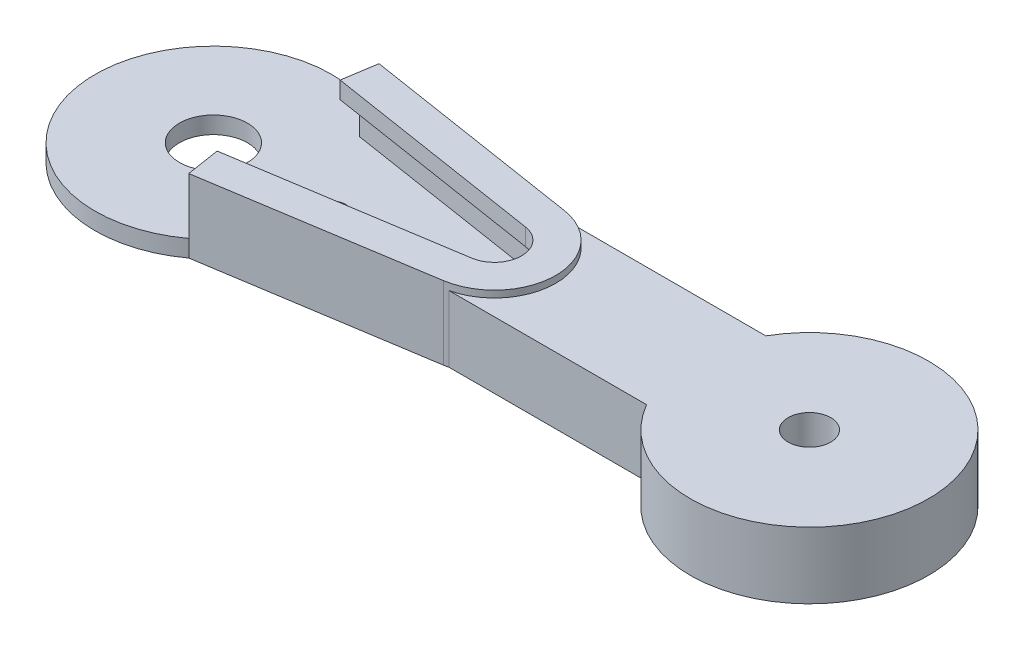
ISO-10303-21;
HEADER;
FILE_DESCRIPTION(('STEP AP214'),'2;1');
FILE_NAME('part.step','',(''),(''),'','','');
FILE_SCHEMA(('AUTOMOTIVE_DESIGN { 1 0 10303 214 1 1 1 1 }'));
ENDSEC;
DATA;
#1=APPLICATION_CONTEXT('core data for automotive mechanical design processes');
#2=APPLICATION_PROTOCOL_DEFINITION('international standard','automotive_design',2000,#1);
#3=PRODUCT_CONTEXT('',#1,'mechanical');
#4=PRODUCT('Part','Part','',(#3));
#5=PRODUCT_RELATED_PRODUCT_CATEGORY('part','',(#4));
#6=PRODUCT_DEFINITION_FORMATION('','',#4);
#7=PRODUCT_DEFINITION_CONTEXT('part definition',#1,'design');
#8=PRODUCT_DEFINITION('design','',#6,#7);
#9=PRODUCT_DEFINITION_SHAPE('','',#8);
#10=(LENGTH_UNIT() NAMED_UNIT(*) SI_UNIT(.MILLI.,.METRE.));
#11=(NAMED_UNIT(*) PLANE_ANGLE_UNIT() SI_UNIT($,.RADIAN.));
#12=(NAMED_UNIT(*) SI_UNIT($,.STERADIAN.) SOLID_ANGLE_UNIT());
#13=UNCERTAINTY_MEASURE_WITH_UNIT(LENGTH_MEASURE(1.E-05),#10,'distance_accuracy_value','');
#14=(GEOMETRIC_REPRESENTATION_CONTEXT(3) GLOBAL_UNCERTAINTY_ASSIGNED_CONTEXT((#13)) GLOBAL_UNIT_ASSIGNED_CONTEXT((#10,
#11,#12)) REPRESENTATION_CONTEXT('',''));
#15=CARTESIAN_POINT('',(0.,0.,0.));
#16=DIRECTION('',(0.,0.,1.));
#17=DIRECTION('',(1.,0.,0.));
#18=AXIS2_PLACEMENT_3D('',#15,#16,#17);
#19=CARTESIAN_POINT('',(7.,1.15,0.));
#20=DIRECTION('',(0.,-1.,0.));
#21=DIRECTION('',(0.,0.,-1.));
#22=AXIS2_PLACEMENT_3D('',#19,#20,#21);
#23=CYLINDRICAL_SURFACE('',#22,0.750000000000002);
#24=CARTESIAN_POINT('',(7.,-2.15,0.));
#25=DIRECTION('',(0.,-1.,0.));
#26=DIRECTION('',(0.,0.,-1.));
#27=AXIS2_PLACEMENT_3D('',#24,#25,#26);
#28=CIRCLE('',#27,0.749999999999999);
#29=CARTESIAN_POINT('',(7.,-2.15,-0.749999999999999));
#30=VERTEX_POINT('',#29);
#31=EDGE_CURVE('E290',#30,#30,#28,.T.);
#32=ORIENTED_EDGE('',*,*,#31,.T.);
#33=EDGE_LOOP('',(#32));
#34=FACE_BOUND('',#33,.T.);
#35=CARTESIAN_POINT('',(7.,-1.15,0.));
#36=DIRECTION('',(0.,1.,0.));
#37=DIRECTION('',(0.,0.,1.));
#38=AXIS2_PLACEMENT_3D('',#35,#36,#37);
#39=CIRCLE('',#38,0.750000000000002);
#40=CARTESIAN_POINT('',(7.,-1.15,0.750000000000065));
#41=VERTEX_POINT('',#40);
#42=EDGE_CURVE('E375',#41,#41,#39,.T.);
#43=ORIENTED_EDGE('',*,*,#42,.T.);
#44=EDGE_LOOP('',(#43));
#45=FACE_BOUND('',#44,.T.);
#46=ADVANCED_FACE('F47',(#34,#45),#23,.F.);
#47=CARTESIAN_POINT('',(16.,1.15,0.));
#48=DIRECTION('',(0.,-1.,0.));
#49=DIRECTION('',(0.,0.,-1.));
#50=AXIS2_PLACEMENT_3D('',#47,#48,#49);
#51=CYLINDRICAL_SURFACE('',#50,0.750000000000002);
#52=CARTESIAN_POINT('',(16.,-2.15,0.));
#53=DIRECTION('',(0.,-1.,0.));
#54=DIRECTION('',(0.,0.,-1.));
#55=AXIS2_PLACEMENT_3D('',#52,#53,#54);
#56=CIRCLE('',#55,0.749999999999998);
#57=CARTESIAN_POINT('',(16.,-2.15,-0.749999999999998));
#58=VERTEX_POINT('',#57);
#59=EDGE_CURVE('E386',#58,#58,#56,.T.);
#60=ORIENTED_EDGE('',*,*,#59,.T.);
#61=EDGE_LOOP('',(#60));
#62=FACE_BOUND('',#61,.T.);
#63=CARTESIAN_POINT('',(16.,-1.15,0.));
#64=DIRECTION('',(0.,1.,0.));
#65=DIRECTION('',(0.,0.,1.));
#66=AXIS2_PLACEMENT_3D('',#63,#64,#65);
#67=CIRCLE('',#66,0.750000000000002);
#68=CARTESIAN_POINT('',(16.,-1.15,0.750000000000002));
#69=VERTEX_POINT('',#68);
#70=EDGE_CURVE('E385',#69,#69,#67,.T.);
#71=ORIENTED_EDGE('',*,*,#70,.T.);
#72=EDGE_LOOP('',(#71));
#73=FACE_BOUND('',#72,.T.);
#74=ADVANCED_FACE('F451',(#62,#73),#51,.F.);
#75=CARTESIAN_POINT('',(13.,1.15,0.));
#76=DIRECTION('',(0.,-1.,0.));
#77=DIRECTION('',(0.,0.,-1.));
#78=AXIS2_PLACEMENT_3D('',#75,#76,#77);
#79=CYLINDRICAL_SURFACE('',#78,0.750000000000002);
#80=CARTESIAN_POINT('',(13.,-2.15,0.));
#81=DIRECTION('',(0.,-1.,0.));
#82=DIRECTION('',(0.,0.,-1.));
#83=AXIS2_PLACEMENT_3D('',#80,#81,#82);
#84=CIRCLE('',#83,0.749999999999998);
#85=CARTESIAN_POINT('',(13.,-2.15,-0.749999999999998));
#86=VERTEX_POINT('',#85);
#87=EDGE_CURVE('E381',#86,#86,#84,.T.);
#88=ORIENTED_EDGE('',*,*,#87,.T.);
#89=EDGE_LOOP('',(#88));
#90=FACE_BOUND('',#89,.T.);
#91=CARTESIAN_POINT('',(13.,-1.15,0.));
#92=DIRECTION('',(0.,1.,0.));
#93=DIRECTION('',(0.,0.,1.));
#94=AXIS2_PLACEMENT_3D('',#91,#92,#93);
#95=CIRCLE('',#94,0.750000000000002);
#96=CARTESIAN_POINT('',(13.,-1.15,0.750000000000023));
#97=VERTEX_POINT('',#96);
#98=EDGE_CURVE('E380',#97,#97,#95,.T.);
#99=ORIENTED_EDGE('',*,*,#98,.T.);
#100=EDGE_LOOP('',(#99));
#101=FACE_BOUND('',#100,.T.);
#102=ADVANCED_FACE('F457',(#90,#101),#79,.F.);
#103=CARTESIAN_POINT('',(10.,1.15,0.));
#104=DIRECTION('',(0.,-1.,0.));
#105=DIRECTION('',(0.,0.,-1.));
#106=AXIS2_PLACEMENT_3D('',#103,#104,#105);
#107=CYLINDRICAL_SURFACE('',#106,0.750000000000002);
#108=CARTESIAN_POINT('',(10.,-2.15,0.));
#109=DIRECTION('',(0.,-1.,0.));
#110=DIRECTION('',(0.,0.,-1.));
#111=AXIS2_PLACEMENT_3D('',#108,#109,#110);
#112=CIRCLE('',#111,0.75);
#113=CARTESIAN_POINT('',(10.,-2.15,-0.75));
#114=VERTEX_POINT('',#113);
#115=EDGE_CURVE('E376',#114,#114,#112,.T.);
#116=ORIENTED_EDGE('',*,*,#115,.T.);
#117=EDGE_LOOP('',(#116));
#118=FACE_BOUND('',#117,.T.);
#119=CARTESIAN_POINT('',(10.,-1.15,0.));
#120=DIRECTION('',(0.,1.,0.));
#121=DIRECTION('',(0.,0.,1.));
#122=AXIS2_PLACEMENT_3D('',#119,#120,#121);
#123=CIRCLE('',#122,0.750000000000002);
#124=CARTESIAN_POINT('',(10.,-1.15,0.750000000000044));
#125=VERTEX_POINT('',#124);
#126=EDGE_CURVE('E331',#125,#125,#123,.T.);
#127=ORIENTED_EDGE('',*,*,#126,.T.);
#128=EDGE_LOOP('',(#127));
#129=FACE_BOUND('',#128,.T.);
#130=ADVANCED_FACE('F402',(#118,#129),#107,.F.);
#131=CARTESIAN_POINT('',(0.,-2.15,0.));
#132=DIRECTION('',(0.,1.,0.));
#133=DIRECTION('',(0.,0.,1.));
#134=AXIS2_PLACEMENT_3D('',#131,#132,#133);
#135=CYLINDRICAL_SURFACE('',#134,2.);
#136=CARTESIAN_POINT('',(0.,-2.15,0.));
#137=DIRECTION('',(0.,-1.,0.));
#138=DIRECTION('',(0.,0.,-1.));
#139=AXIS2_PLACEMENT_3D('',#136,#137,#138);
#140=CIRCLE('',#139,2.);
#141=CARTESIAN_POINT('',(0.,-2.15,-2.));
#142=VERTEX_POINT('',#141);
#143=EDGE_CURVE('E327',#142,#142,#140,.T.);
#144=ORIENTED_EDGE('',*,*,#143,.T.);
#145=EDGE_LOOP('',(#144));
#146=FACE_BOUND('',#145,.T.);
#147=CARTESIAN_POINT('',(0.,-1.15,0.));
#148=DIRECTION('',(0.,1.,0.));
#149=DIRECTION('',(0.,0.,1.));
#150=AXIS2_PLACEMENT_3D('',#147,#148,#149);
#151=CIRCLE('',#150,2.);
#152=CARTESIAN_POINT('',(0.,-1.15,2.));
#153=VERTEX_POINT('',#152);
#154=EDGE_CURVE('E51',#153,#153,#151,.T.);
#155=ORIENTED_EDGE('',*,*,#154,.T.);
#156=EDGE_LOOP('',(#155));
#157=FACE_BOUND('',#156,.T.);
#158=ADVANCED_FACE('F470',(#146,#157),#135,.F.);
#159=CARTESIAN_POINT('',(17.0588844447433,-2.15,3.55635321325428));
#160=DIRECTION('',(-0.155245679095352,0.,-0.987875892570632));
#161=DIRECTION('',(-0.987875892570632,0.,0.155245679095352));
#162=AXIS2_PLACEMENT_3D('',#159,#160,#161);
#163=PLANE('',#162);
#164=DIRECTION('',(0.,1.,0.));
#165=VECTOR('',#164,1.);
#166=CARTESIAN_POINT('',(17.0588844447433,-2.15,3.55635321325428));
#167=LINE('',#166,#165);
#168=CARTESIAN_POINT('',(17.0588844447433,-2.15,3.55635321325428));
#169=VERTEX_POINT('',#168);
#170=CARTESIAN_POINT('',(17.0588844447433,2.15,3.55635321325427));
#171=VERTEX_POINT('',#170);
#172=EDGE_CURVE('E300',#169,#171,#167,.T.);
#173=ORIENTED_EDGE('',*,*,#172,.T.);
#174=DIRECTION('',(0.987875892570632,0.,-0.155245679095352));
#175=VECTOR('',#174,1.);
#176=CARTESIAN_POINT('',(0.956554589226585,2.15,6.08685036602117));
#177=LINE('',#176,#175);
#178=CARTESIAN_POINT('',(4.13939721360178,2.15,5.58666348182769));
#179=VERTEX_POINT('',#178);
#180=EDGE_CURVE('E256',#179,#171,#177,.T.);
#181=ORIENTED_EDGE('',*,*,#180,.F.);
#182=DIRECTION('',(0.,-1.,0.));
#183=VECTOR('',#182,1.);
#184=CARTESIAN_POINT('',(4.13939721360178,1.15,5.58666348182769));
#185=LINE('',#184,#183);
#186=CARTESIAN_POINT('',(4.13939721360178,-1.15,5.58666348182769));
#187=VERTEX_POINT('',#186);
#188=EDGE_CURVE('E299',#179,#187,#185,.T.);
#189=ORIENTED_EDGE('',*,*,#188,.T.);
#190=DIRECTION('',(0.,1.,0.));
#191=VECTOR('',#190,1.);
#192=CARTESIAN_POINT('',(4.13939721360177,-2.15,5.5866634818277));
#193=LINE('',#192,#191);
#194=CARTESIAN_POINT('',(4.13939721360177,-2.15,5.5866634818277));
#195=VERTEX_POINT('',#194);
#196=EDGE_CURVE('E303',#195,#187,#193,.T.);
#197=ORIENTED_EDGE('',*,*,#196,.F.);
#198=DIRECTION('',(-0.987875892570632,0.,0.155245679095352));
#199=VECTOR('',#198,1.);
#200=CARTESIAN_POINT('',(17.0588844447433,-2.15,3.55635321325428));
#201=LINE('',#200,#199);
#202=EDGE_CURVE('E310',#169,#195,#201,.T.);
#203=ORIENTED_EDGE('',*,*,#202,.F.);
#204=EDGE_LOOP('',(#173,#181,#189,#197,#203));
#205=FACE_BOUND('',#204,.T.);
#206=ADVANCED_FACE('F426',(#205),#163,.F.);
#207=CARTESIAN_POINT('',(16.5,-2.15,0.));
#208=DIRECTION('',(0.,1.,0.));
#209=DIRECTION('',(0.,0.,1.));
#210=AXIS2_PLACEMENT_3D('',#207,#208,#209);
#211=CYLINDRICAL_SURFACE('',#210,3.6);
#212=CARTESIAN_POINT('',(16.5,1.75,0.));
#213=DIRECTION('',(0.,-1.,0.));
#214=DIRECTION('',(0.,0.,-1.));
#215=AXIS2_PLACEMENT_3D('',#212,#213,#214);
#216=CIRCLE('',#215,3.6);
#217=CARTESIAN_POINT('',(17.3426149773176,1.75,-3.5));
#218=VERTEX_POINT('',#217);
#219=CARTESIAN_POINT('',(17.3426149773176,1.75,3.5));
#220=VERTEX_POINT('',#219);
#221=EDGE_CURVE('E180',#218,#220,#216,.T.);
#222=ORIENTED_EDGE('',*,*,#221,.F.);
#223=DIRECTION('',(0.,-1.,0.));
#224=VECTOR('',#223,1.);
#225=CARTESIAN_POINT('',(17.3426149773176,1.75,-3.5));
#226=LINE('',#225,#224);
#227=CARTESIAN_POINT('',(17.3426149773176,-2.15,-3.5));
#228=VERTEX_POINT('',#227);
#229=EDGE_CURVE('E222',#218,#228,#226,.T.);
#230=ORIENTED_EDGE('',*,*,#229,.T.);
#231=CARTESIAN_POINT('',(16.5,-2.15,0.));
#232=DIRECTION('',(0.,-1.,0.));
#233=DIRECTION('',(0.,0.,-1.));
#234=AXIS2_PLACEMENT_3D('',#231,#232,#233);
#235=CIRCLE('',#234,3.6);
#236=CARTESIAN_POINT('',(17.0588844447433,-2.15,-3.55635321325428));
#237=VERTEX_POINT('',#236);
#238=EDGE_CURVE('E314',#237,#228,#235,.T.);
#239=ORIENTED_EDGE('',*,*,#238,.F.);
#240=DIRECTION('',(0.,1.,0.));
#241=VECTOR('',#240,1.);
#242=CARTESIAN_POINT('',(17.0588844447433,-2.15,-3.55635321325428));
#243=LINE('',#242,#241);
#244=CARTESIAN_POINT('',(17.0588844447433,2.15,-3.55635321325427));
#245=VERTEX_POINT('',#244);
#246=EDGE_CURVE('E296',#237,#245,#243,.T.);
#247=ORIENTED_EDGE('',*,*,#246,.T.);
#248=CARTESIAN_POINT('',(16.5,2.15,0.));
#249=DIRECTION('',(0.,1.,0.));
#250=DIRECTION('',(0.,0.,1.));
#251=AXIS2_PLACEMENT_3D('',#248,#249,#250);
#252=CIRCLE('',#251,3.6);
#253=EDGE_CURVE('E228',#171,#245,#252,.T.);
#254=ORIENTED_EDGE('',*,*,#253,.F.);
#255=ORIENTED_EDGE('',*,*,#172,.F.);
#256=CARTESIAN_POINT('',(17.3426149773176,-2.15,3.5));
#257=VERTEX_POINT('',#256);
#258=EDGE_CURVE('E318',#257,#169,#235,.T.);
#259=ORIENTED_EDGE('',*,*,#258,.F.);
#260=DIRECTION('',(0.,-1.,0.));
#261=VECTOR('',#260,1.);
#262=CARTESIAN_POINT('',(17.3426149773176,1.75,3.5));
#263=LINE('',#262,#261);
#264=EDGE_CURVE('E190',#220,#257,#263,.T.);
#265=ORIENTED_EDGE('',*,*,#264,.F.);
#266=EDGE_LOOP('',(#222,#230,#239,#247,#254,#255,#259,#265));
#267=FACE_BOUND('',#266,.T.);
#268=ADVANCED_FACE('F423',(#267),#211,.T.);
#269=CARTESIAN_POINT('',(4.13939721360177,-2.15,-5.58666348182769));
#270=DIRECTION('',(-0.155245679095352,0.,0.987875892570632));
#271=DIRECTION('',(0.987875892570632,0.,0.155245679095352));
#272=AXIS2_PLACEMENT_3D('',#269,#270,#271);
#273=PLANE('',#272);
#274=DIRECTION('',(0.,1.,0.));
#275=VECTOR('',#274,1.);
#276=CARTESIAN_POINT('',(4.13939721360177,-2.15,-5.58666348182769));
#277=LINE('',#276,#275);
#278=CARTESIAN_POINT('',(4.13939721360177,-2.15,-5.58666348182769));
#279=VERTEX_POINT('',#278);
#280=CARTESIAN_POINT('',(4.13939721360177,-1.15,-5.58666348182769));
#281=VERTEX_POINT('',#280);
#282=EDGE_CURVE('E291',#279,#281,#277,.T.);
#283=ORIENTED_EDGE('',*,*,#282,.T.);
#284=DIRECTION('',(0.,-1.,0.));
#285=VECTOR('',#284,1.);
#286=CARTESIAN_POINT('',(4.13939721360177,1.15,-5.58666348182769));
#287=LINE('',#286,#285);
#288=CARTESIAN_POINT('',(4.13939721360177,2.15,-5.5866634818277));
#289=VERTEX_POINT('',#288);
#290=EDGE_CURVE('E313',#289,#281,#287,.T.);
#291=ORIENTED_EDGE('',*,*,#290,.F.);
#292=DIRECTION('',(-0.987875892570632,0.,-0.155245679095352));
#293=VECTOR('',#292,1.);
#294=CARTESIAN_POINT('',(0.956554589226585,2.15,-6.08685036602117));
#295=LINE('',#294,#293);
#296=EDGE_CURVE('E232',#245,#289,#295,.T.);
#297=ORIENTED_EDGE('',*,*,#296,.F.);
#298=ORIENTED_EDGE('',*,*,#246,.F.);
#299=DIRECTION('',(0.987875892570632,0.,0.155245679095352));
#300=VECTOR('',#299,1.);
#301=CARTESIAN_POINT('',(4.13939721360177,-2.15,-5.58666348182769));
#302=LINE('',#301,#300);
#303=EDGE_CURVE('E319',#279,#237,#302,.T.);
#304=ORIENTED_EDGE('',*,*,#303,.F.);
#305=EDGE_LOOP('',(#283,#291,#297,#298,#304));
#306=FACE_BOUND('',#305,.T.);
#307=ADVANCED_FACE('F436',(#306),#273,.F.);
#308=CARTESIAN_POINT('',(0.,-2.15,0.));
#309=DIRECTION('',(0.,1.,0.));
#310=DIRECTION('',(0.,0.,1.));
#311=AXIS2_PLACEMENT_3D('',#308,#309,#310);
#312=CYLINDRICAL_SURFACE('',#311,6.95308695121536);
#313=CARTESIAN_POINT('',(0.,-1.15,0.));
#314=DIRECTION('',(0.,-1.,0.));
#315=DIRECTION('',(0.,0.,-1.));
#316=AXIS2_PLACEMENT_3D('',#313,#314,#315);
#317=CIRCLE('',#316,6.95308695121536);
#318=EDGE_CURVE('E295',#187,#281,#317,.T.);
#319=ORIENTED_EDGE('',*,*,#318,.T.);
#320=ORIENTED_EDGE('',*,*,#282,.F.);
#321=CARTESIAN_POINT('',(0.,-2.15,0.));
#322=DIRECTION('',(0.,-1.,0.));
#323=DIRECTION('',(0.,0.,-1.));
#324=AXIS2_PLACEMENT_3D('',#321,#322,#323);
#325=CIRCLE('',#324,6.95308695121536);
#326=EDGE_CURVE('E322',#195,#279,#325,.T.);
#327=ORIENTED_EDGE('',*,*,#326,.F.);
#328=ORIENTED_EDGE('',*,*,#196,.T.);
#329=EDGE_LOOP('',(#319,#320,#327,#328));
#330=FACE_BOUND('',#329,.T.);
#331=ADVANCED_FACE('F408',(#330),#312,.T.);
#332=CARTESIAN_POINT('',(0.,-1.15,0.));
#333=DIRECTION('',(0.,-1.,0.));
#334=DIRECTION('',(0.,0.,-1.));
#335=AXIS2_PLACEMENT_3D('',#332,#333,#334);
#336=PLANE('',#335);
#337=DIRECTION('',(-0.987875892570632,0.,-0.155245679095352));
#338=VECTOR('',#337,1.);
#339=CARTESIAN_POINT('',(0.801308910131233,-1.15,-5.09897447345054));
#340=LINE('',#339,#338);
#341=CARTESIAN_POINT('',(16.9036387656479,-1.15,-2.56847732068364));
#342=VERTEX_POINT('',#341);
#343=CARTESIAN_POINT('',(3.98415153450642,-1.15,-4.59878758925706));
#344=VERTEX_POINT('',#343);
#345=EDGE_CURVE('E307',#342,#344,#340,.T.);
#346=ORIENTED_EDGE('',*,*,#345,.T.);
#347=DIRECTION('',(0.15524567909535,0.,-0.987875892570632));
#348=VECTOR('',#347,1.);
#349=CARTESIAN_POINT('',(3.1828426243752,-1.15,0.500186884193477));
#350=LINE('',#349,#348);
#351=EDGE_CURVE('E351',#344,#281,#350,.T.);
#352=ORIENTED_EDGE('',*,*,#351,.T.);
#353=ORIENTED_EDGE('',*,*,#318,.F.);
#354=DIRECTION('',(-0.155245679095351,0.,-0.987875892570632));
#355=VECTOR('',#354,1.);
#356=CARTESIAN_POINT('',(3.18284262437519,-1.15,-0.500186884193479));
#357=LINE('',#356,#355);
#358=CARTESIAN_POINT('',(3.98415153450643,-1.15,4.59878758925706));
#359=VERTEX_POINT('',#358);
#360=EDGE_CURVE('E326',#187,#359,#357,.T.);
#361=ORIENTED_EDGE('',*,*,#360,.T.);
#362=DIRECTION('',(-0.987875892570632,0.,0.155245679095352));
#363=VECTOR('',#362,1.);
#364=CARTESIAN_POINT('',(0.801308910131233,-1.15,5.09897447345054));
#365=LINE('',#364,#363);
#366=CARTESIAN_POINT('',(16.9036387656479,-1.15,2.56847732068364));
#367=VERTEX_POINT('',#366);
#368=EDGE_CURVE('E339',#367,#359,#365,.T.);
#369=ORIENTED_EDGE('',*,*,#368,.F.);
#370=CARTESIAN_POINT('',(16.5,-1.15,0.));
#371=DIRECTION('',(0.,-1.,0.));
#372=DIRECTION('',(0.,0.,-1.));
#373=AXIS2_PLACEMENT_3D('',#370,#371,#372);
#374=CIRCLE('',#373,2.6);
#375=EDGE_CURVE('E343',#342,#367,#374,.T.);
#376=ORIENTED_EDGE('',*,*,#375,.F.);
#377=EDGE_LOOP('',(#346,#352,#353,#361,#369,#376));
#378=FACE_BOUND('',#377,.T.);
#379=ORIENTED_EDGE('',*,*,#42,.F.);
#380=EDGE_LOOP('',(#379));
#381=FACE_BOUND('',#380,.T.);
#382=ORIENTED_EDGE('',*,*,#70,.F.);
#383=EDGE_LOOP('',(#382));
#384=FACE_BOUND('',#383,.T.);
#385=ORIENTED_EDGE('',*,*,#98,.F.);
#386=EDGE_LOOP('',(#385));
#387=FACE_BOUND('',#386,.T.);
#388=ORIENTED_EDGE('',*,*,#126,.F.);
#389=EDGE_LOOP('',(#388));
#390=FACE_BOUND('',#389,.T.);
#391=ORIENTED_EDGE('',*,*,#154,.F.);
#392=EDGE_LOOP('',(#391));
#393=FACE_BOUND('',#392,.T.);
#394=ADVANCED_FACE('F404',(#378,#381,#384,#387,#390,#393),#336,.F.);
#395=CARTESIAN_POINT('',(0.,-2.15,0.));
#396=DIRECTION('',(0.,-1.,0.));
#397=DIRECTION('',(0.,0.,-1.));
#398=AXIS2_PLACEMENT_3D('',#395,#396,#397);
#399=PLANE('',#398);
#400=ORIENTED_EDGE('',*,*,#59,.F.);
#401=EDGE_LOOP('',(#400));
#402=FACE_BOUND('',#401,.T.);
#403=ORIENTED_EDGE('',*,*,#87,.F.);
#404=EDGE_LOOP('',(#403));
#405=FACE_BOUND('',#404,.T.);
#406=ORIENTED_EDGE('',*,*,#115,.F.);
#407=EDGE_LOOP('',(#406));
#408=FACE_BOUND('',#407,.T.);
#409=ORIENTED_EDGE('',*,*,#31,.F.);
#410=EDGE_LOOP('',(#409));
#411=FACE_BOUND('',#410,.T.);
#412=ORIENTED_EDGE('',*,*,#326,.T.);
#413=ORIENTED_EDGE('',*,*,#303,.T.);
#414=ORIENTED_EDGE('',*,*,#238,.T.);
#415=DIRECTION('',(1.,0.,0.));
#416=VECTOR('',#415,1.);
#417=CARTESIAN_POINT('',(0.,-2.15,-3.5));
#418=LINE('',#417,#416);
#419=CARTESIAN_POINT('',(28.9378221735089,-2.15,-3.5));
#420=VERTEX_POINT('',#419);
#421=EDGE_CURVE('E200',#228,#420,#418,.T.);
#422=ORIENTED_EDGE('',*,*,#421,.T.);
#423=CARTESIAN_POINT('',(35.,-2.15,0.));
#424=DIRECTION('',(0.,-1.,0.));
#425=DIRECTION('',(0.,0.,-1.));
#426=AXIS2_PLACEMENT_3D('',#423,#424,#425);
#427=CIRCLE('',#426,7.);
#428=CARTESIAN_POINT('',(28.9378221735089,-2.15,3.5));
#429=VERTEX_POINT('',#428);
#430=EDGE_CURVE('E211',#420,#429,#427,.T.);
#431=ORIENTED_EDGE('',*,*,#430,.T.);
#432=DIRECTION('',(1.,0.,0.));
#433=VECTOR('',#432,1.);
#434=CARTESIAN_POINT('',(0.,-2.15,3.5));
#435=LINE('',#434,#433);
#436=EDGE_CURVE('E65',#257,#429,#435,.T.);
#437=ORIENTED_EDGE('',*,*,#436,.F.);
#438=ORIENTED_EDGE('',*,*,#258,.T.);
#439=ORIENTED_EDGE('',*,*,#202,.T.);
#440=EDGE_LOOP('',(#412,#413,#414,#422,#431,#437,#438,#439));
#441=FACE_BOUND('',#440,.T.);
#442=ORIENTED_EDGE('',*,*,#143,.F.);
#443=EDGE_LOOP('',(#442));
#444=FACE_BOUND('',#443,.T.);
#445=CARTESIAN_POINT('',(35.,-2.15,0.));
#446=DIRECTION('',(0.,-1.,0.));
#447=DIRECTION('',(0.,0.,-1.));
#448=AXIS2_PLACEMENT_3D('',#445,#446,#447);
#449=CIRCLE('',#448,1.25);
#450=CARTESIAN_POINT('',(35.,-2.15,-1.25));
#451=VERTEX_POINT('',#450);
#452=EDGE_CURVE('E196',#451,#451,#449,.T.);
#453=ORIENTED_EDGE('',*,*,#452,.F.);
#454=EDGE_LOOP('',(#453));
#455=FACE_BOUND('',#454,.T.);
#456=ADVANCED_FACE('F407',(#402,#405,#408,#411,#441,#444,#455),#399,.T.);
#457=CARTESIAN_POINT('',(3.1828426243752,1.15,0.500186884193477));
#458=DIRECTION('',(-0.987875892570632,0.,-0.15524567909535));
#459=DIRECTION('',(-0.15524567909535,0.,0.987875892570632));
#460=AXIS2_PLACEMENT_3D('',#457,#458,#459);
#461=PLANE('',#460);
#462=ORIENTED_EDGE('',*,*,#351,.F.);
#463=DIRECTION('',(0.,-1.,0.));
#464=VECTOR('',#463,1.);
#465=CARTESIAN_POINT('',(3.98415153450642,1.15,-4.59878758925706));
#466=LINE('',#465,#464);
#467=CARTESIAN_POINT('',(3.98415153450642,1.15,-4.59878758925706));
#468=VERTEX_POINT('',#467);
#469=EDGE_CURVE('E344',#468,#344,#466,.T.);
#470=ORIENTED_EDGE('',*,*,#469,.F.);
#471=DIRECTION('',(-0.15524567909535,0.,0.987875892570632));
#472=VECTOR('',#471,1.);
#473=CARTESIAN_POINT('',(3.1828426243752,1.15,0.500186884193477));
#474=LINE('',#473,#472);
#475=CARTESIAN_POINT('',(3.82890585541107,1.15,-3.61091169668643));
#476=VERTEX_POINT('',#475);
#477=EDGE_CURVE('E221',#468,#476,#474,.T.);
#478=ORIENTED_EDGE('',*,*,#477,.T.);
#479=DIRECTION('',(0.,-1.,0.));
#480=VECTOR('',#479,1.);
#481=CARTESIAN_POINT('',(3.82890585541107,2.15,-3.61091169668643));
#482=LINE('',#481,#480);
#483=CARTESIAN_POINT('',(3.82890585541107,2.15,-3.61091169668643));
#484=VERTEX_POINT('',#483);
#485=EDGE_CURVE('E286',#484,#476,#482,.T.);
#486=ORIENTED_EDGE('',*,*,#485,.F.);
#487=DIRECTION('',(-0.15524567909535,0.,0.987875892570632));
#488=VECTOR('',#487,1.);
#489=CARTESIAN_POINT('',(3.1828426243752,2.15,0.500186884193477));
#490=LINE('',#489,#488);
#491=EDGE_CURVE('E237',#289,#484,#490,.T.);
#492=ORIENTED_EDGE('',*,*,#491,.F.);
#493=ORIENTED_EDGE('',*,*,#290,.T.);
#494=EDGE_LOOP('',(#462,#470,#478,#486,#492,#493));
#495=FACE_BOUND('',#494,.T.);
#496=ADVANCED_FACE('F49',(#495),#461,.T.);
#497=CARTESIAN_POINT('',(0.801308910131233,1.15,-5.09897447345054));
#498=DIRECTION('',(-0.155245679095352,0.,0.987875892570632));
#499=DIRECTION('',(0.987875892570632,0.,0.155245679095352));
#500=AXIS2_PLACEMENT_3D('',#497,#498,#499);
#501=PLANE('',#500);
#502=ORIENTED_EDGE('',*,*,#345,.F.);
#503=DIRECTION('',(0.,-1.,0.));
#504=VECTOR('',#503,1.);
#505=CARTESIAN_POINT('',(16.9036387656479,1.15,-2.56847732068364));
#506=LINE('',#505,#504);
#507=CARTESIAN_POINT('',(16.9036387656479,1.15,-2.56847732068364));
#508=VERTEX_POINT('',#507);
#509=EDGE_CURVE('E340',#508,#342,#506,.T.);
#510=ORIENTED_EDGE('',*,*,#509,.F.);
#511=DIRECTION('',(-0.987875892570632,0.,-0.155245679095352));
#512=VECTOR('',#511,1.);
#513=CARTESIAN_POINT('',(0.801308910131233,1.15,-5.09897447345054));
#514=LINE('',#513,#512);
#515=EDGE_CURVE('E347',#508,#468,#514,.T.);
#516=ORIENTED_EDGE('',*,*,#515,.T.);
#517=ORIENTED_EDGE('',*,*,#469,.T.);
#518=EDGE_LOOP('',(#502,#510,#516,#517));
#519=FACE_BOUND('',#518,.T.);
#520=ADVANCED_FACE('F496',(#519),#501,.T.);
#521=CARTESIAN_POINT('',(16.5,1.15,0.));
#522=DIRECTION('',(0.,-1.,0.));
#523=DIRECTION('',(0.,0.,-1.));
#524=AXIS2_PLACEMENT_3D('',#521,#522,#523);
#525=CYLINDRICAL_SURFACE('',#524,2.6);
#526=ORIENTED_EDGE('',*,*,#375,.T.);
#527=DIRECTION('',(0.,-1.,0.));
#528=VECTOR('',#527,1.);
#529=CARTESIAN_POINT('',(16.9036387656479,1.15,2.56847732068364));
#530=LINE('',#529,#528);
#531=CARTESIAN_POINT('',(16.9036387656479,1.15,2.56847732068364));
#532=VERTEX_POINT('',#531);
#533=EDGE_CURVE('E73',#532,#367,#530,.T.);
#534=ORIENTED_EDGE('',*,*,#533,.F.);
#535=CARTESIAN_POINT('',(16.5,1.15,0.));
#536=DIRECTION('',(0.,-1.,0.));
#537=DIRECTION('',(0.,0.,-1.));
#538=AXIS2_PLACEMENT_3D('',#535,#536,#537);
#539=CIRCLE('',#538,2.6);
#540=EDGE_CURVE('E57',#508,#532,#539,.T.);
#541=ORIENTED_EDGE('',*,*,#540,.F.);
#542=ORIENTED_EDGE('',*,*,#509,.T.);
#543=EDGE_LOOP('',(#526,#534,#541,#542));
#544=FACE_BOUND('',#543,.T.);
#545=ADVANCED_FACE('F493',(#544),#525,.F.);
#546=CARTESIAN_POINT('',(0.801308910131233,1.15,5.09897447345054));
#547=DIRECTION('',(0.155245679095352,0.,0.987875892570632));
#548=DIRECTION('',(0.987875892570632,0.,-0.155245679095352));
#549=AXIS2_PLACEMENT_3D('',#546,#547,#548);
#550=PLANE('',#549);
#551=ORIENTED_EDGE('',*,*,#368,.T.);
#552=DIRECTION('',(0.,-1.,0.));
#553=VECTOR('',#552,1.);
#554=CARTESIAN_POINT('',(3.98415153450643,1.15,4.59878758925706));
#555=LINE('',#554,#553);
#556=CARTESIAN_POINT('',(3.98415153450643,1.15,4.59878758925706));
#557=VERTEX_POINT('',#556);
#558=EDGE_CURVE('E334',#557,#359,#555,.T.);
#559=ORIENTED_EDGE('',*,*,#558,.F.);
#560=DIRECTION('',(-0.987875892570632,0.,0.155245679095352));
#561=VECTOR('',#560,1.);
#562=CARTESIAN_POINT('',(0.801308910131233,1.15,5.09897447345054));
#563=LINE('',#562,#561);
#564=EDGE_CURVE('E11',#532,#557,#563,.T.);
#565=ORIENTED_EDGE('',*,*,#564,.F.);
#566=ORIENTED_EDGE('',*,*,#533,.T.);
#567=EDGE_LOOP('',(#551,#559,#565,#566));
#568=FACE_BOUND('',#567,.T.);
#569=ADVANCED_FACE('F489',(#568),#550,.F.);
#570=CARTESIAN_POINT('',(3.18284262437519,1.15,-0.500186884193479));
#571=DIRECTION('',(-0.987875892570632,0.,0.155245679095351));
#572=DIRECTION('',(0.155245679095351,0.,0.987875892570632));
#573=AXIS2_PLACEMENT_3D('',#570,#571,#572);
#574=PLANE('',#573);
#575=ORIENTED_EDGE('',*,*,#360,.F.);
#576=ORIENTED_EDGE('',*,*,#188,.F.);
#577=DIRECTION('',(0.155245679095351,0.,0.987875892570632));
#578=VECTOR('',#577,1.);
#579=CARTESIAN_POINT('',(3.18284262437519,2.15,-0.500186884193479));
#580=LINE('',#579,#578);
#581=CARTESIAN_POINT('',(3.82890585541107,2.15,3.61091169668643));
#582=VERTEX_POINT('',#581);
#583=EDGE_CURVE('E252',#582,#179,#580,.T.);
#584=ORIENTED_EDGE('',*,*,#583,.F.);
#585=DIRECTION('',(0.,-1.,0.));
#586=VECTOR('',#585,1.);
#587=CARTESIAN_POINT('',(3.82890585541107,2.15,3.61091169668643));
#588=LINE('',#587,#586);
#589=CARTESIAN_POINT('',(3.82890585541107,1.15,3.61091169668643));
#590=VERTEX_POINT('',#589);
#591=EDGE_CURVE('E260',#582,#590,#588,.T.);
#592=ORIENTED_EDGE('',*,*,#591,.T.);
#593=DIRECTION('',(0.155245679095351,0.,0.987875892570632));
#594=VECTOR('',#593,1.);
#595=CARTESIAN_POINT('',(3.18284262437519,1.15,-0.500186884193479));
#596=LINE('',#595,#594);
#597=EDGE_CURVE('E233',#590,#557,#596,.T.);
#598=ORIENTED_EDGE('',*,*,#597,.T.);
#599=ORIENTED_EDGE('',*,*,#558,.T.);
#600=EDGE_LOOP('',(#575,#576,#584,#592,#598,#599));
#601=FACE_BOUND('',#600,.T.);
#602=ADVANCED_FACE('F486',(#601),#574,.T.);
#603=CARTESIAN_POINT('',(0.646063231035882,2.15,-4.11109858087991));
#604=DIRECTION('',(-0.155245679095352,0.,0.987875892570632));
#605=DIRECTION('',(0.987875892570632,0.,0.155245679095352));
#606=AXIS2_PLACEMENT_3D('',#603,#604,#605);
#607=PLANE('',#606);
#608=DIRECTION('',(-0.987875892570632,0.,-0.155245679095352));
#609=VECTOR('',#608,1.);
#610=CARTESIAN_POINT('',(0.646063231035882,1.15,-4.11109858087991));
#611=LINE('',#610,#609);
#612=CARTESIAN_POINT('',(16.7483930865526,1.15,-1.58060142811301));
#613=VERTEX_POINT('',#612);
#614=EDGE_CURVE('E263',#613,#476,#611,.T.);
#615=ORIENTED_EDGE('',*,*,#614,.F.);
#616=DIRECTION('',(0.,-1.,0.));
#617=VECTOR('',#616,1.);
#618=CARTESIAN_POINT('',(16.7483930865526,2.15,-1.58060142811301));
#619=LINE('',#618,#617);
#620=CARTESIAN_POINT('',(16.7483930865526,2.15,-1.58060142811301));
#621=VERTEX_POINT('',#620);
#622=EDGE_CURVE('E283',#621,#613,#619,.T.);
#623=ORIENTED_EDGE('',*,*,#622,.F.);
#624=DIRECTION('',(-0.987875892570632,0.,-0.155245679095352));
#625=VECTOR('',#624,1.);
#626=CARTESIAN_POINT('',(0.646063231035882,2.15,-4.11109858087991));
#627=LINE('',#626,#625);
#628=EDGE_CURVE('E240',#621,#484,#627,.T.);
#629=ORIENTED_EDGE('',*,*,#628,.T.);
#630=ORIENTED_EDGE('',*,*,#485,.T.);
#631=EDGE_LOOP('',(#615,#623,#629,#630));
#632=FACE_BOUND('',#631,.T.);
#633=ADVANCED_FACE('F462',(#632),#607,.T.);
#634=CARTESIAN_POINT('',(16.5,2.15,0.));
#635=DIRECTION('',(0.,-1.,0.));
#636=DIRECTION('',(0.,0.,-1.));
#637=AXIS2_PLACEMENT_3D('',#634,#635,#636);
#638=CYLINDRICAL_SURFACE('',#637,1.6);
#639=CARTESIAN_POINT('',(16.5,1.15,0.));
#640=DIRECTION('',(0.,1.,0.));
#641=DIRECTION('',(0.,0.,1.));
#642=AXIS2_PLACEMENT_3D('',#639,#640,#641);
#643=CIRCLE('',#642,1.6);
#644=CARTESIAN_POINT('',(16.7483930865526,1.15,1.58060142811301));
#645=VERTEX_POINT('',#644);
#646=EDGE_CURVE('E267',#645,#613,#643,.T.);
#647=ORIENTED_EDGE('',*,*,#646,.F.);
#648=DIRECTION('',(0.,-1.,0.));
#649=VECTOR('',#648,1.);
#650=CARTESIAN_POINT('',(16.7483930865526,2.15,1.58060142811301));
#651=LINE('',#650,#649);
#652=CARTESIAN_POINT('',(16.7483930865526,2.15,1.58060142811301));
#653=VERTEX_POINT('',#652);
#654=EDGE_CURVE('E280',#653,#645,#651,.T.);
#655=ORIENTED_EDGE('',*,*,#654,.F.);
#656=CARTESIAN_POINT('',(16.5,2.15,0.));
#657=DIRECTION('',(0.,1.,0.));
#658=DIRECTION('',(0.,0.,1.));
#659=AXIS2_PLACEMENT_3D('',#656,#657,#658);
#660=CIRCLE('',#659,1.6);
#661=EDGE_CURVE('E244',#653,#621,#660,.T.);
#662=ORIENTED_EDGE('',*,*,#661,.T.);
#663=ORIENTED_EDGE('',*,*,#622,.T.);
#664=EDGE_LOOP('',(#647,#655,#662,#663));
#665=FACE_BOUND('',#664,.T.);
#666=ADVANCED_FACE('F523',(#665),#638,.F.);
#667=CARTESIAN_POINT('',(0.646063231035882,2.15,4.11109858087991));
#668=DIRECTION('',(-0.155245679095352,0.,-0.987875892570632));
#669=DIRECTION('',(-0.987875892570632,0.,0.155245679095352));
#670=AXIS2_PLACEMENT_3D('',#667,#668,#669);
#671=PLANE('',#670);
#672=DIRECTION('',(0.987875892570632,0.,-0.155245679095352));
#673=VECTOR('',#672,1.);
#674=CARTESIAN_POINT('',(0.646063231035882,1.15,4.11109858087991));
#675=LINE('',#674,#673);
#676=EDGE_CURVE('E271',#590,#645,#675,.T.);
#677=ORIENTED_EDGE('',*,*,#676,.F.);
#678=ORIENTED_EDGE('',*,*,#591,.F.);
#679=DIRECTION('',(0.987875892570632,0.,-0.155245679095352));
#680=VECTOR('',#679,1.);
#681=CARTESIAN_POINT('',(0.646063231035882,2.15,4.11109858087991));
#682=LINE('',#681,#680);
#683=EDGE_CURVE('E248',#582,#653,#682,.T.);
#684=ORIENTED_EDGE('',*,*,#683,.T.);
#685=ORIENTED_EDGE('',*,*,#654,.T.);
#686=EDGE_LOOP('',(#677,#678,#684,#685));
#687=FACE_BOUND('',#686,.T.);
#688=ADVANCED_FACE('F526',(#687),#671,.T.);
#689=CARTESIAN_POINT('',(0.,2.15,0.));
#690=DIRECTION('',(0.,1.,0.));
#691=DIRECTION('',(0.,0.,1.));
#692=AXIS2_PLACEMENT_3D('',#689,#690,#691);
#693=PLANE('',#692);
#694=ORIENTED_EDGE('',*,*,#253,.T.);
#695=ORIENTED_EDGE('',*,*,#296,.T.);
#696=ORIENTED_EDGE('',*,*,#491,.T.);
#697=ORIENTED_EDGE('',*,*,#628,.F.);
#698=ORIENTED_EDGE('',*,*,#661,.F.);
#699=ORIENTED_EDGE('',*,*,#683,.F.);
#700=ORIENTED_EDGE('',*,*,#583,.T.);
#701=ORIENTED_EDGE('',*,*,#180,.T.);
#702=EDGE_LOOP('',(#694,#695,#696,#697,#698,#699,#700,#701));
#703=FACE_BOUND('',#702,.T.);
#704=ADVANCED_FACE('F519',(#703),#693,.T.);
#705=CARTESIAN_POINT('',(0.,1.15,0.));
#706=DIRECTION('',(0.,1.,0.));
#707=DIRECTION('',(0.,0.,1.));
#708=AXIS2_PLACEMENT_3D('',#705,#706,#707);
#709=PLANE('',#708);
#710=ORIENTED_EDGE('',*,*,#515,.F.);
#711=ORIENTED_EDGE('',*,*,#540,.T.);
#712=ORIENTED_EDGE('',*,*,#564,.T.);
#713=ORIENTED_EDGE('',*,*,#597,.F.);
#714=ORIENTED_EDGE('',*,*,#676,.T.);
#715=ORIENTED_EDGE('',*,*,#646,.T.);
#716=ORIENTED_EDGE('',*,*,#614,.T.);
#717=ORIENTED_EDGE('',*,*,#477,.F.);
#718=EDGE_LOOP('',(#710,#711,#712,#713,#714,#715,#716,#717));
#719=FACE_BOUND('',#718,.T.);
#720=ADVANCED_FACE('F447',(#719),#709,.F.);
#721=CARTESIAN_POINT('',(35.,1.75,0.));
#722=DIRECTION('',(0.,-1.,0.));
#723=DIRECTION('',(0.,0.,-1.));
#724=AXIS2_PLACEMENT_3D('',#721,#722,#723);
#725=CYLINDRICAL_SURFACE('',#724,7.);
#726=ORIENTED_EDGE('',*,*,#430,.F.);
#727=DIRECTION('',(0.,-1.,0.));
#728=VECTOR('',#727,1.);
#729=CARTESIAN_POINT('',(28.9378221735089,1.75,-3.5));
#730=LINE('',#729,#728);
#731=CARTESIAN_POINT('',(28.9378221735089,1.75,-3.5));
#732=VERTEX_POINT('',#731);
#733=EDGE_CURVE('E194',#732,#420,#730,.T.);
#734=ORIENTED_EDGE('',*,*,#733,.F.);
#735=CARTESIAN_POINT('',(35.,1.75,0.));
#736=DIRECTION('',(0.,-1.,0.));
#737=DIRECTION('',(0.,0.,-1.));
#738=AXIS2_PLACEMENT_3D('',#735,#736,#737);
#739=CIRCLE('',#738,7.);
#740=CARTESIAN_POINT('',(28.9378221735089,1.75,3.5));
#741=VERTEX_POINT('',#740);
#742=EDGE_CURVE('E177',#732,#741,#739,.T.);
#743=ORIENTED_EDGE('',*,*,#742,.T.);
#744=DIRECTION('',(0.,-1.,0.));
#745=VECTOR('',#744,1.);
#746=CARTESIAN_POINT('',(28.9378221735089,1.75,3.5));
#747=LINE('',#746,#745);
#748=EDGE_CURVE('E185',#741,#429,#747,.T.);
#749=ORIENTED_EDGE('',*,*,#748,.T.);
#750=EDGE_LOOP('',(#726,#734,#743,#749));
#751=FACE_BOUND('',#750,.T.);
#752=ADVANCED_FACE('F193',(#751),#725,.T.);
#753=CARTESIAN_POINT('',(0.,1.75,-3.5));
#754=DIRECTION('',(0.,0.,-1.));
#755=DIRECTION('',(-1.,0.,0.));
#756=AXIS2_PLACEMENT_3D('',#753,#754,#755);
#757=PLANE('',#756);
#758=ORIENTED_EDGE('',*,*,#421,.F.);
#759=ORIENTED_EDGE('',*,*,#229,.F.);
#760=DIRECTION('',(1.,0.,0.));
#761=VECTOR('',#760,1.);
#762=CARTESIAN_POINT('',(0.,1.75,-3.5));
#763=LINE('',#762,#761);
#764=EDGE_CURVE('E205',#218,#732,#763,.T.);
#765=ORIENTED_EDGE('',*,*,#764,.T.);
#766=ORIENTED_EDGE('',*,*,#733,.T.);
#767=EDGE_LOOP('',(#758,#759,#765,#766));
#768=FACE_BOUND('',#767,.T.);
#769=ADVANCED_FACE('F438',(#768),#757,.T.);
#770=CARTESIAN_POINT('',(0.,1.75,3.5));
#771=DIRECTION('',(0.,0.,-1.));
#772=DIRECTION('',(-1.,0.,0.));
#773=AXIS2_PLACEMENT_3D('',#770,#771,#772);
#774=PLANE('',#773);
#775=ORIENTED_EDGE('',*,*,#436,.T.);
#776=ORIENTED_EDGE('',*,*,#748,.F.);
#777=DIRECTION('',(1.,0.,0.));
#778=VECTOR('',#777,1.);
#779=CARTESIAN_POINT('',(0.,1.75,3.5));
#780=LINE('',#779,#778);
#781=EDGE_CURVE('E171',#220,#741,#780,.T.);
#782=ORIENTED_EDGE('',*,*,#781,.F.);
#783=ORIENTED_EDGE('',*,*,#264,.T.);
#784=EDGE_LOOP('',(#775,#776,#782,#783));
#785=FACE_BOUND('',#784,.T.);
#786=ADVANCED_FACE('F186',(#785),#774,.F.);
#787=CARTESIAN_POINT('',(35.,1.75,0.));
#788=DIRECTION('',(0.,-1.,0.));
#789=DIRECTION('',(0.,0.,-1.));
#790=AXIS2_PLACEMENT_3D('',#787,#788,#789);
#791=CYLINDRICAL_SURFACE('',#790,1.25);
#792=CARTESIAN_POINT('',(35.,1.75,0.));
#793=DIRECTION('',(0.,-1.,0.));
#794=DIRECTION('',(0.,0.,-1.));
#795=AXIS2_PLACEMENT_3D('',#792,#793,#794);
#796=CIRCLE('',#795,1.25);
#797=CARTESIAN_POINT('',(35.,1.75,-1.25));
#798=VERTEX_POINT('',#797);
#799=EDGE_CURVE('E191',#798,#798,#796,.T.);
#800=ORIENTED_EDGE('',*,*,#799,.F.);
#801=EDGE_LOOP('',(#800));
#802=FACE_BOUND('',#801,.T.);
#803=ORIENTED_EDGE('',*,*,#452,.T.);
#804=EDGE_LOOP('',(#803));
#805=FACE_BOUND('',#804,.T.);
#806=ADVANCED_FACE('F445',(#802,#805),#791,.F.);
#807=CARTESIAN_POINT('',(0.,1.75,0.));
#808=DIRECTION('',(0.,-1.,0.));
#809=DIRECTION('',(0.,0.,-1.));
#810=AXIS2_PLACEMENT_3D('',#807,#808,#809);
#811=PLANE('',#810);
#812=ORIENTED_EDGE('',*,*,#742,.F.);
#813=ORIENTED_EDGE('',*,*,#764,.F.);
#814=ORIENTED_EDGE('',*,*,#221,.T.);
#815=ORIENTED_EDGE('',*,*,#781,.T.);
#816=EDGE_LOOP('',(#812,#813,#814,#815));
#817=FACE_BOUND('',#816,.T.);
#818=ORIENTED_EDGE('',*,*,#799,.T.);
#819=EDGE_LOOP('',(#818));
#820=FACE_BOUND('',#819,.T.);
#821=ADVANCED_FACE('F173',(#817,#820),#811,.F.);
#822=CLOSED_SHELL('',(#46,#74,#102,#130,#158,#206,#268,#307,#331,#394,#456,#496,#520,#545,#569,
#602,#633,#666,#688,#704,#720,#752,#769,#786,#806,#821));
#823=MANIFOLD_SOLID_BREP('B2',#822);
#824=ADVANCED_BREP_SHAPE_REPRESENTATION('',(#18,#823),#14);
#825=SHAPE_DEFINITION_REPRESENTATION(#9,#824);
ENDSEC;
END-ISO-10303-21;
